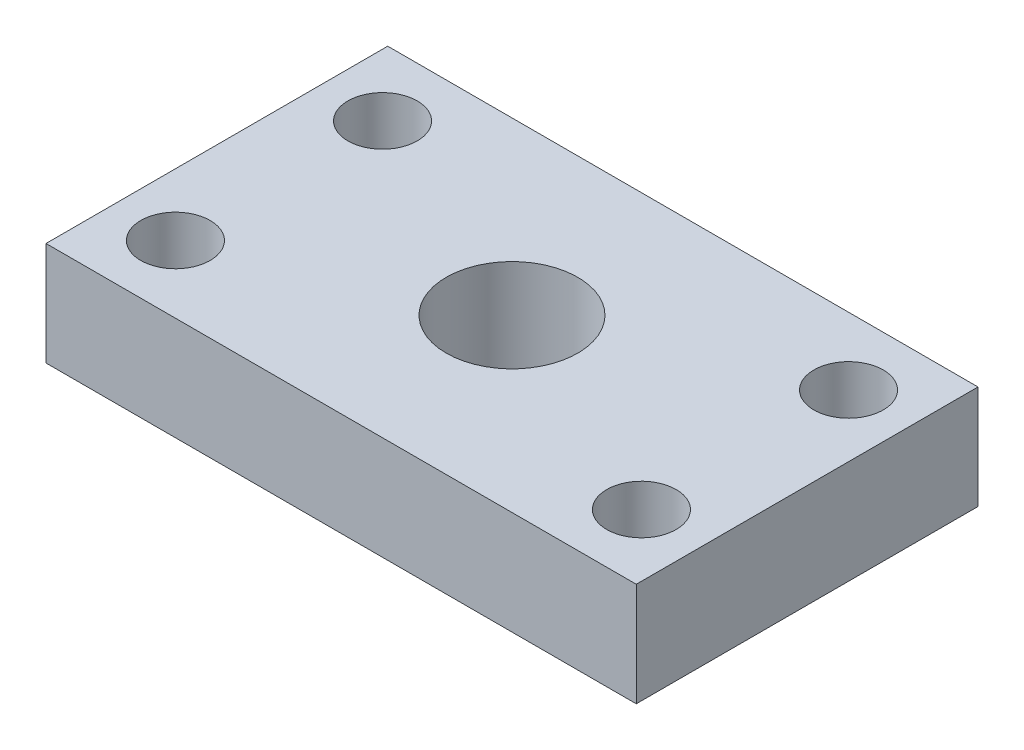
ISO-10303-21;
HEADER;
FILE_DESCRIPTION(('STEP AP214'),'2;1');
FILE_NAME('part.step','',(''),(''),'','','');
FILE_SCHEMA(('AUTOMOTIVE_DESIGN { 1 0 10303 214 1 1 1 1 }'));
ENDSEC;
DATA;
#1=APPLICATION_CONTEXT('core data for automotive mechanical design processes');
#2=APPLICATION_PROTOCOL_DEFINITION('international standard','automotive_design',2000,#1);
#3=PRODUCT_CONTEXT('',#1,'mechanical');
#4=PRODUCT('Part','Part','',(#3));
#5=PRODUCT_RELATED_PRODUCT_CATEGORY('part','',(#4));
#6=PRODUCT_DEFINITION_FORMATION('','',#4);
#7=PRODUCT_DEFINITION_CONTEXT('part definition',#1,'design');
#8=PRODUCT_DEFINITION('design','',#6,#7);
#9=PRODUCT_DEFINITION_SHAPE('','',#8);
#10=(LENGTH_UNIT() NAMED_UNIT(*) SI_UNIT(.MILLI.,.METRE.));
#11=(NAMED_UNIT(*) PLANE_ANGLE_UNIT() SI_UNIT($,.RADIAN.));
#12=(NAMED_UNIT(*) SI_UNIT($,.STERADIAN.) SOLID_ANGLE_UNIT());
#13=UNCERTAINTY_MEASURE_WITH_UNIT(LENGTH_MEASURE(1.E-05),#10,'distance_accuracy_value','');
#14=(GEOMETRIC_REPRESENTATION_CONTEXT(3) GLOBAL_UNCERTAINTY_ASSIGNED_CONTEXT((#13)) GLOBAL_UNIT_ASSIGNED_CONTEXT((#10,
#11,#12)) REPRESENTATION_CONTEXT('',''));
#15=CARTESIAN_POINT('',(0.,0.,0.));
#16=DIRECTION('',(0.,0.,1.));
#17=DIRECTION('',(1.,0.,0.));
#18=AXIS2_PLACEMENT_3D('',#15,#16,#17);
#19=CARTESIAN_POINT('',(0.,10.,0.));
#20=DIRECTION('',(1.,0.,0.));
#21=DIRECTION('',(0.,0.,-1.));
#22=AXIS2_PLACEMENT_3D('',#19,#20,#21);
#23=PLANE('',#22);
#24=DIRECTION('',(0.,0.,1.));
#25=VECTOR('',#24,1.);
#26=CARTESIAN_POINT('',(0.,0.,0.));
#27=LINE('',#26,#25);
#28=CARTESIAN_POINT('',(0.,0.,-33.));
#29=VERTEX_POINT('',#28);
#30=CARTESIAN_POINT('',(0.,0.,0.));
#31=VERTEX_POINT('',#30);
#32=EDGE_CURVE('E139',#29,#31,#27,.T.);
#33=ORIENTED_EDGE('',*,*,#32,.T.);
#34=DIRECTION('',(0.,-1.,0.));
#35=VECTOR('',#34,1.);
#36=CARTESIAN_POINT('',(0.,10.,0.));
#37=LINE('',#36,#35);
#38=CARTESIAN_POINT('',(0.,10.,0.));
#39=VERTEX_POINT('',#38);
#40=EDGE_CURVE('E13',#39,#31,#37,.T.);
#41=ORIENTED_EDGE('',*,*,#40,.F.);
#42=DIRECTION('',(0.,0.,1.));
#43=VECTOR('',#42,1.);
#44=CARTESIAN_POINT('',(0.,10.,0.));
#45=LINE('',#44,#43);
#46=CARTESIAN_POINT('',(0.,10.,-33.));
#47=VERTEX_POINT('',#46);
#48=EDGE_CURVE('E142',#47,#39,#45,.T.);
#49=ORIENTED_EDGE('',*,*,#48,.F.);
#50=DIRECTION('',(0.,-1.,0.));
#51=VECTOR('',#50,1.);
#52=CARTESIAN_POINT('',(0.,10.,-33.));
#53=LINE('',#52,#51);
#54=EDGE_CURVE('E148',#47,#29,#53,.T.);
#55=ORIENTED_EDGE('',*,*,#54,.T.);
#56=EDGE_LOOP('',(#33,#41,#49,#55));
#57=FACE_BOUND('',#56,.T.);
#58=ADVANCED_FACE('F49',(#57),#23,.F.);
#59=CARTESIAN_POINT('',(0.,10.,0.));
#60=DIRECTION('',(0.,0.,-1.));
#61=DIRECTION('',(-1.,0.,0.));
#62=AXIS2_PLACEMENT_3D('',#59,#60,#61);
#63=PLANE('',#62);
#64=DIRECTION('',(1.,0.,0.));
#65=VECTOR('',#64,1.);
#66=CARTESIAN_POINT('',(0.,0.,0.));
#67=LINE('',#66,#65);
#68=CARTESIAN_POINT('',(57.,0.,0.));
#69=VERTEX_POINT('',#68);
#70=EDGE_CURVE('E151',#31,#69,#67,.T.);
#71=ORIENTED_EDGE('',*,*,#70,.T.);
#72=DIRECTION('',(0.,-1.,0.));
#73=VECTOR('',#72,1.);
#74=CARTESIAN_POINT('',(57.,10.,0.));
#75=LINE('',#74,#73);
#76=CARTESIAN_POINT('',(57.,10.,0.));
#77=VERTEX_POINT('',#76);
#78=EDGE_CURVE('E57',#77,#69,#75,.T.);
#79=ORIENTED_EDGE('',*,*,#78,.F.);
#80=DIRECTION('',(1.,0.,0.));
#81=VECTOR('',#80,1.);
#82=CARTESIAN_POINT('',(0.,10.,0.));
#83=LINE('',#82,#81);
#84=EDGE_CURVE('E96',#39,#77,#83,.T.);
#85=ORIENTED_EDGE('',*,*,#84,.F.);
#86=ORIENTED_EDGE('',*,*,#40,.T.);
#87=EDGE_LOOP('',(#71,#79,#85,#86));
#88=FACE_BOUND('',#87,.T.);
#89=ADVANCED_FACE('F176',(#88),#63,.F.);
#90=CARTESIAN_POINT('',(57.,10.,0.));
#91=DIRECTION('',(-1.,0.,0.));
#92=DIRECTION('',(0.,0.,1.));
#93=AXIS2_PLACEMENT_3D('',#90,#91,#92);
#94=PLANE('',#93);
#95=DIRECTION('',(0.,0.,-1.));
#96=VECTOR('',#95,1.);
#97=CARTESIAN_POINT('',(57.,0.,0.));
#98=LINE('',#97,#96);
#99=CARTESIAN_POINT('',(57.,0.,-33.));
#100=VERTEX_POINT('',#99);
#101=EDGE_CURVE('E83',#69,#100,#98,.T.);
#102=ORIENTED_EDGE('',*,*,#101,.T.);
#103=DIRECTION('',(0.,-1.,0.));
#104=VECTOR('',#103,1.);
#105=CARTESIAN_POINT('',(57.,10.,-33.));
#106=LINE('',#105,#104);
#107=CARTESIAN_POINT('',(57.,10.,-33.));
#108=VERTEX_POINT('',#107);
#109=EDGE_CURVE('E156',#108,#100,#106,.T.);
#110=ORIENTED_EDGE('',*,*,#109,.F.);
#111=DIRECTION('',(0.,0.,-1.));
#112=VECTOR('',#111,1.);
#113=CARTESIAN_POINT('',(57.,10.,0.));
#114=LINE('',#113,#112);
#115=EDGE_CURVE('E145',#77,#108,#114,.T.);
#116=ORIENTED_EDGE('',*,*,#115,.F.);
#117=ORIENTED_EDGE('',*,*,#78,.T.);
#118=EDGE_LOOP('',(#102,#110,#116,#117));
#119=FACE_BOUND('',#118,.T.);
#120=ADVANCED_FACE('F158',(#119),#94,.F.);
#121=CARTESIAN_POINT('',(0.,10.,-33.));
#122=DIRECTION('',(0.,0.,1.));
#123=DIRECTION('',(1.,0.,0.));
#124=AXIS2_PLACEMENT_3D('',#121,#122,#123);
#125=PLANE('',#124);
#126=CARTESIAN_POINT('',(28.5,5.,-33.));
#127=DIRECTION('',(0.,0.,-1.));
#128=DIRECTION('',(-1.,0.,0.));
#129=AXIS2_PLACEMENT_3D('',#126,#127,#128);
#130=CIRCLE('',#129,1.72719999999999);
#131=CARTESIAN_POINT('',(26.7728,5.,-33.));
#132=VERTEX_POINT('',#131);
#133=EDGE_CURVE('E111',#132,#132,#130,.T.);
#134=ORIENTED_EDGE('',*,*,#133,.F.);
#135=EDGE_LOOP('',(#134));
#136=FACE_BOUND('',#135,.T.);
#137=DIRECTION('',(-1.,0.,0.));
#138=VECTOR('',#137,1.);
#139=CARTESIAN_POINT('',(0.,0.,-33.));
#140=LINE('',#139,#138);
#141=EDGE_CURVE('E89',#100,#29,#140,.T.);
#142=ORIENTED_EDGE('',*,*,#141,.T.);
#143=ORIENTED_EDGE('',*,*,#54,.F.);
#144=DIRECTION('',(-1.,0.,0.));
#145=VECTOR('',#144,1.);
#146=CARTESIAN_POINT('',(0.,10.,-33.));
#147=LINE('',#146,#145);
#148=EDGE_CURVE('E65',#108,#47,#147,.T.);
#149=ORIENTED_EDGE('',*,*,#148,.F.);
#150=ORIENTED_EDGE('',*,*,#109,.T.);
#151=EDGE_LOOP('',(#142,#143,#149,#150));
#152=FACE_BOUND('',#151,.T.);
#153=ADVANCED_FACE('F165',(#136,#152),#125,.F.);
#154=CARTESIAN_POINT('',(0.,10.,0.));
#155=DIRECTION('',(0.,-1.,0.));
#156=DIRECTION('',(0.,0.,-1.));
#157=AXIS2_PLACEMENT_3D('',#154,#155,#156);
#158=PLANE('',#157);
#159=CARTESIAN_POINT('',(28.5,10.,-16.5));
#160=DIRECTION('',(0.,1.,0.));
#161=DIRECTION('',(0.,0.,1.));
#162=AXIS2_PLACEMENT_3D('',#159,#160,#161);
#163=CIRCLE('',#162,6.34999999999999);
#164=CARTESIAN_POINT('',(28.5,10.,-10.15));
#165=VERTEX_POINT('',#164);
#166=EDGE_CURVE('E284',#165,#165,#163,.T.);
#167=ORIENTED_EDGE('',*,*,#166,.F.);
#168=EDGE_LOOP('',(#167));
#169=FACE_BOUND('',#168,.T.);
#170=CARTESIAN_POINT('',(51.,10.,-6.5));
#171=DIRECTION('',(0.,-1.,0.));
#172=DIRECTION('',(0.,0.,-1.));
#173=AXIS2_PLACEMENT_3D('',#170,#171,#172);
#174=CIRCLE('',#173,3.35000000000001);
#175=CARTESIAN_POINT('',(51.,10.,-9.85000000000001));
#176=VERTEX_POINT('',#175);
#177=EDGE_CURVE('E114',#176,#176,#174,.T.);
#178=ORIENTED_EDGE('',*,*,#177,.T.);
#179=EDGE_LOOP('',(#178));
#180=FACE_BOUND('',#179,.T.);
#181=CARTESIAN_POINT('',(6.00000000000001,10.,-26.5));
#182=DIRECTION('',(0.,-1.,0.));
#183=DIRECTION('',(0.,0.,-1.));
#184=AXIS2_PLACEMENT_3D('',#181,#182,#183);
#185=CIRCLE('',#184,3.35);
#186=CARTESIAN_POINT('',(6.00000000000001,10.,-29.85));
#187=VERTEX_POINT('',#186);
#188=EDGE_CURVE('E124',#187,#187,#185,.T.);
#189=ORIENTED_EDGE('',*,*,#188,.T.);
#190=EDGE_LOOP('',(#189));
#191=FACE_BOUND('',#190,.T.);
#192=CARTESIAN_POINT('',(51.,10.,-26.5));
#193=DIRECTION('',(0.,-1.,0.));
#194=DIRECTION('',(0.,0.,-1.));
#195=AXIS2_PLACEMENT_3D('',#192,#193,#194);
#196=CIRCLE('',#195,3.35000000000001);
#197=CARTESIAN_POINT('',(51.,10.,-29.85));
#198=VERTEX_POINT('',#197);
#199=EDGE_CURVE('E130',#198,#198,#196,.T.);
#200=ORIENTED_EDGE('',*,*,#199,.T.);
#201=EDGE_LOOP('',(#200));
#202=FACE_BOUND('',#201,.T.);
#203=CARTESIAN_POINT('',(6.,10.,-6.5));
#204=DIRECTION('',(0.,-1.,0.));
#205=DIRECTION('',(0.,0.,-1.));
#206=AXIS2_PLACEMENT_3D('',#203,#204,#205);
#207=CIRCLE('',#206,3.35);
#208=CARTESIAN_POINT('',(6.,10.,-9.85));
#209=VERTEX_POINT('',#208);
#210=EDGE_CURVE('E136',#209,#209,#207,.T.);
#211=ORIENTED_EDGE('',*,*,#210,.T.);
#212=EDGE_LOOP('',(#211));
#213=FACE_BOUND('',#212,.T.);
#214=ORIENTED_EDGE('',*,*,#48,.T.);
#215=ORIENTED_EDGE('',*,*,#84,.T.);
#216=ORIENTED_EDGE('',*,*,#115,.T.);
#217=ORIENTED_EDGE('',*,*,#148,.T.);
#218=EDGE_LOOP('',(#214,#215,#216,#217));
#219=FACE_BOUND('',#218,.T.);
#220=ADVANCED_FACE('F167',(#169,#180,#191,#202,#213,#219),#158,.F.);
#221=CARTESIAN_POINT('',(0.,0.,0.));
#222=DIRECTION('',(0.,-1.,0.));
#223=DIRECTION('',(0.,0.,-1.));
#224=AXIS2_PLACEMENT_3D('',#221,#222,#223);
#225=PLANE('',#224);
#226=CARTESIAN_POINT('',(28.5,0.,-16.5));
#227=DIRECTION('',(0.,1.,0.));
#228=DIRECTION('',(0.,0.,1.));
#229=AXIS2_PLACEMENT_3D('',#226,#227,#228);
#230=CIRCLE('',#229,6.34999999999999);
#231=CARTESIAN_POINT('',(28.5,0.,-10.15));
#232=VERTEX_POINT('',#231);
#233=EDGE_CURVE('E117',#232,#232,#230,.T.);
#234=ORIENTED_EDGE('',*,*,#233,.T.);
#235=EDGE_LOOP('',(#234));
#236=FACE_BOUND('',#235,.T.);
#237=CARTESIAN_POINT('',(51.,0.,-6.5));
#238=DIRECTION('',(0.,-1.,0.));
#239=DIRECTION('',(0.,0.,-1.));
#240=AXIS2_PLACEMENT_3D('',#237,#238,#239);
#241=CIRCLE('',#240,3.35000000000001);
#242=CARTESIAN_POINT('',(51.,0.,-9.85000000000001));
#243=VERTEX_POINT('',#242);
#244=EDGE_CURVE('E110',#243,#243,#241,.T.);
#245=ORIENTED_EDGE('',*,*,#244,.F.);
#246=EDGE_LOOP('',(#245));
#247=FACE_BOUND('',#246,.T.);
#248=CARTESIAN_POINT('',(6.00000000000001,0.,-26.5));
#249=DIRECTION('',(0.,-1.,0.));
#250=DIRECTION('',(0.,0.,-1.));
#251=AXIS2_PLACEMENT_3D('',#248,#249,#250);
#252=CIRCLE('',#251,3.35);
#253=CARTESIAN_POINT('',(6.00000000000001,0.,-29.85));
#254=VERTEX_POINT('',#253);
#255=EDGE_CURVE('E122',#254,#254,#252,.T.);
#256=ORIENTED_EDGE('',*,*,#255,.F.);
#257=EDGE_LOOP('',(#256));
#258=FACE_BOUND('',#257,.T.);
#259=CARTESIAN_POINT('',(51.,0.,-26.5));
#260=DIRECTION('',(0.,-1.,0.));
#261=DIRECTION('',(0.,0.,-1.));
#262=AXIS2_PLACEMENT_3D('',#259,#260,#261);
#263=CIRCLE('',#262,3.35000000000001);
#264=CARTESIAN_POINT('',(51.,0.,-29.85));
#265=VERTEX_POINT('',#264);
#266=EDGE_CURVE('E127',#265,#265,#263,.T.);
#267=ORIENTED_EDGE('',*,*,#266,.F.);
#268=EDGE_LOOP('',(#267));
#269=FACE_BOUND('',#268,.T.);
#270=CARTESIAN_POINT('',(6.,0.,-6.5));
#271=DIRECTION('',(0.,-1.,0.));
#272=DIRECTION('',(0.,0.,-1.));
#273=AXIS2_PLACEMENT_3D('',#270,#271,#272);
#274=CIRCLE('',#273,3.35);
#275=CARTESIAN_POINT('',(6.,0.,-9.85));
#276=VERTEX_POINT('',#275);
#277=EDGE_CURVE('E133',#276,#276,#274,.T.);
#278=ORIENTED_EDGE('',*,*,#277,.F.);
#279=EDGE_LOOP('',(#278));
#280=FACE_BOUND('',#279,.T.);
#281=ORIENTED_EDGE('',*,*,#32,.F.);
#282=ORIENTED_EDGE('',*,*,#141,.F.);
#283=ORIENTED_EDGE('',*,*,#101,.F.);
#284=ORIENTED_EDGE('',*,*,#70,.F.);
#285=EDGE_LOOP('',(#281,#282,#283,#284));
#286=FACE_BOUND('',#285,.T.);
#287=ADVANCED_FACE('F161',(#236,#247,#258,#269,#280,#286),#225,.T.);
#288=CARTESIAN_POINT('',(6.,10.,-6.5));
#289=DIRECTION('',(0.,-1.,0.));
#290=DIRECTION('',(0.,0.,-1.));
#291=AXIS2_PLACEMENT_3D('',#288,#289,#290);
#292=CYLINDRICAL_SURFACE('',#291,3.35);
#293=ORIENTED_EDGE('',*,*,#210,.F.);
#294=EDGE_LOOP('',(#293));
#295=FACE_BOUND('',#294,.T.);
#296=ORIENTED_EDGE('',*,*,#277,.T.);
#297=EDGE_LOOP('',(#296));
#298=FACE_BOUND('',#297,.T.);
#299=ADVANCED_FACE('F196',(#295,#298),#292,.F.);
#300=CARTESIAN_POINT('',(51.,10.,-26.5));
#301=DIRECTION('',(0.,-1.,0.));
#302=DIRECTION('',(0.,0.,-1.));
#303=AXIS2_PLACEMENT_3D('',#300,#301,#302);
#304=CYLINDRICAL_SURFACE('',#303,3.35000000000001);
#305=ORIENTED_EDGE('',*,*,#199,.F.);
#306=EDGE_LOOP('',(#305));
#307=FACE_BOUND('',#306,.T.);
#308=ORIENTED_EDGE('',*,*,#266,.T.);
#309=EDGE_LOOP('',(#308));
#310=FACE_BOUND('',#309,.T.);
#311=ADVANCED_FACE('F201',(#307,#310),#304,.F.);
#312=CARTESIAN_POINT('',(6.00000000000001,10.,-26.5));
#313=DIRECTION('',(0.,-1.,0.));
#314=DIRECTION('',(0.,0.,-1.));
#315=AXIS2_PLACEMENT_3D('',#312,#313,#314);
#316=CYLINDRICAL_SURFACE('',#315,3.35);
#317=ORIENTED_EDGE('',*,*,#188,.F.);
#318=EDGE_LOOP('',(#317));
#319=FACE_BOUND('',#318,.T.);
#320=ORIENTED_EDGE('',*,*,#255,.T.);
#321=EDGE_LOOP('',(#320));
#322=FACE_BOUND('',#321,.T.);
#323=ADVANCED_FACE('F213',(#319,#322),#316,.F.);
#324=CARTESIAN_POINT('',(51.,10.,-6.5));
#325=DIRECTION('',(0.,-1.,0.));
#326=DIRECTION('',(0.,0.,-1.));
#327=AXIS2_PLACEMENT_3D('',#324,#325,#326);
#328=CYLINDRICAL_SURFACE('',#327,3.35000000000001);
#329=ORIENTED_EDGE('',*,*,#177,.F.);
#330=EDGE_LOOP('',(#329));
#331=FACE_BOUND('',#330,.T.);
#332=ORIENTED_EDGE('',*,*,#244,.T.);
#333=EDGE_LOOP('',(#332));
#334=FACE_BOUND('',#333,.T.);
#335=ADVANCED_FACE('F104',(#331,#334),#328,.F.);
#336=CARTESIAN_POINT('',(28.5,5.,-28.));
#337=DIRECTION('',(0.,0.,-1.));
#338=DIRECTION('',(-1.,0.,0.));
#339=AXIS2_PLACEMENT_3D('',#336,#337,#338);
#340=CONICAL_SURFACE('',#339,1.7272,1.02974425867665);
#341=CARTESIAN_POINT('',(28.5,5.,-26.9621935388156));
#342=VERTEX_POINT('',#341);
#343=VERTEX_LOOP('',#342);
#344=FACE_BOUND('',#343,.T.);
#345=CARTESIAN_POINT('',(28.5,5.,-28.));
#346=DIRECTION('',(0.,0.,-1.));
#347=DIRECTION('',(-1.,0.,0.));
#348=AXIS2_PLACEMENT_3D('',#345,#346,#347);
#349=CIRCLE('',#348,1.7272);
#350=CARTESIAN_POINT('',(26.7728,5.,-28.));
#351=VERTEX_POINT('',#350);
#352=EDGE_CURVE('E108',#351,#351,#349,.T.);
#353=ORIENTED_EDGE('',*,*,#352,.T.);
#354=EDGE_LOOP('',(#353));
#355=FACE_BOUND('',#354,.T.);
#356=ADVANCED_FACE('F100',(#344,#355),#340,.F.);
#357=CARTESIAN_POINT('',(28.5,5.,-33.));
#358=DIRECTION('',(0.,0.,-1.));
#359=DIRECTION('',(-1.,0.,0.));
#360=AXIS2_PLACEMENT_3D('',#357,#358,#359);
#361=CYLINDRICAL_SURFACE('',#360,1.72719999999999);
#362=ORIENTED_EDGE('',*,*,#352,.F.);
#363=EDGE_LOOP('',(#362));
#364=FACE_BOUND('',#363,.T.);
#365=ORIENTED_EDGE('',*,*,#133,.T.);
#366=EDGE_LOOP('',(#365));
#367=FACE_BOUND('',#366,.T.);
#368=ADVANCED_FACE('F103',(#364,#367),#361,.F.);
#369=CARTESIAN_POINT('',(28.5,10.,-16.5));
#370=DIRECTION('',(0.,1.,0.));
#371=DIRECTION('',(0.,0.,1.));
#372=AXIS2_PLACEMENT_3D('',#369,#370,#371);
#373=CYLINDRICAL_SURFACE('',#372,6.34999999999999);
#374=ORIENTED_EDGE('',*,*,#233,.F.);
#375=EDGE_LOOP('',(#374));
#376=FACE_BOUND('',#375,.T.);
#377=ORIENTED_EDGE('',*,*,#166,.T.);
#378=EDGE_LOOP('',(#377));
#379=FACE_BOUND('',#378,.T.);
#380=ADVANCED_FACE('F252',(#376,#379),#373,.F.);
#381=CLOSED_SHELL('',(#58,#89,#120,#153,#220,#287,#299,#311,#323,#335,#356,#368,#380));
#382=MANIFOLD_SOLID_BREP('B2',#381);
#383=ADVANCED_BREP_SHAPE_REPRESENTATION('',(#18,#382),#14);
#384=SHAPE_DEFINITION_REPRESENTATION(#9,#383);
ENDSEC;
END-ISO-10303-21;
